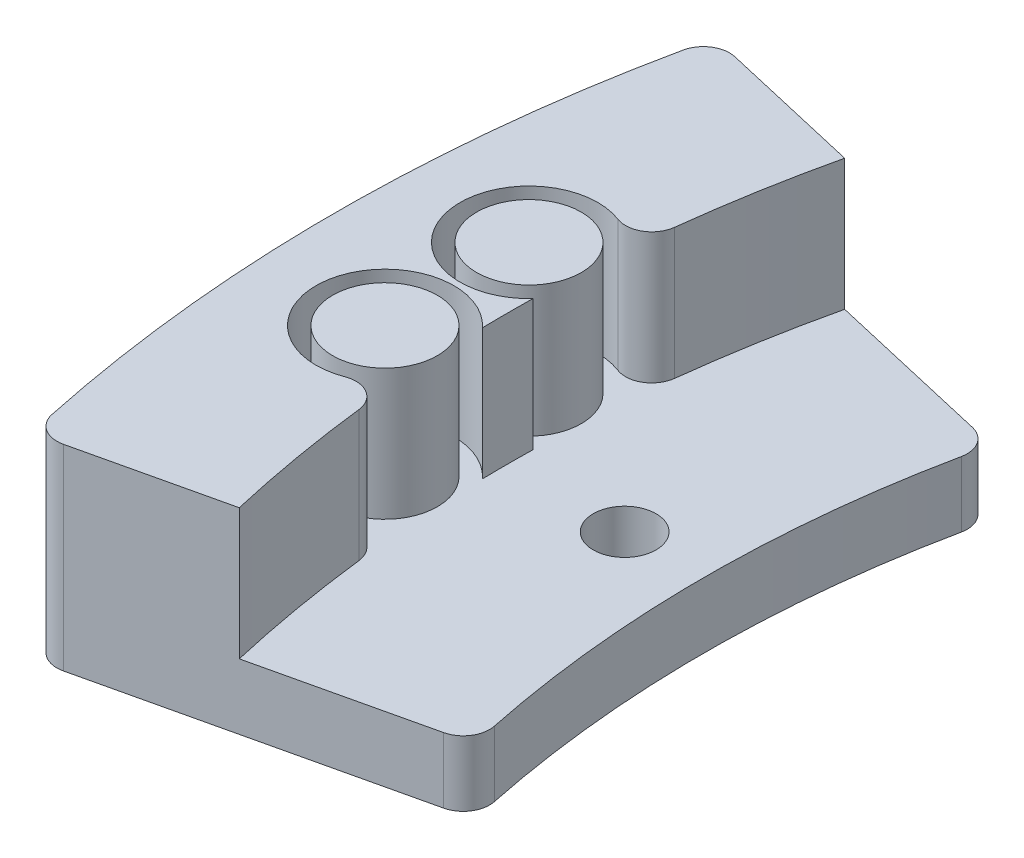
ISO-10303-21;
HEADER;
FILE_DESCRIPTION(('STEP AP214'),'2;1');
FILE_NAME('part.step','',(''),(''),'','','');
FILE_SCHEMA(('AUTOMOTIVE_DESIGN { 1 0 10303 214 1 1 1 1 }'));
ENDSEC;
DATA;
#1=APPLICATION_CONTEXT('core data for automotive mechanical design processes');
#2=APPLICATION_PROTOCOL_DEFINITION('international standard','automotive_design',2000,#1);
#3=PRODUCT_CONTEXT('',#1,'mechanical');
#4=PRODUCT('Part','Part','',(#3));
#5=PRODUCT_RELATED_PRODUCT_CATEGORY('part','',(#4));
#6=PRODUCT_DEFINITION_FORMATION('','',#4);
#7=PRODUCT_DEFINITION_CONTEXT('part definition',#1,'design');
#8=PRODUCT_DEFINITION('design','',#6,#7);
#9=PRODUCT_DEFINITION_SHAPE('','',#8);
#10=(LENGTH_UNIT() NAMED_UNIT(*) SI_UNIT(.MILLI.,.METRE.));
#11=(NAMED_UNIT(*) PLANE_ANGLE_UNIT() SI_UNIT($,.RADIAN.));
#12=(NAMED_UNIT(*) SI_UNIT($,.STERADIAN.) SOLID_ANGLE_UNIT());
#13=UNCERTAINTY_MEASURE_WITH_UNIT(LENGTH_MEASURE(1.E-05),#10,'distance_accuracy_value','');
#14=(GEOMETRIC_REPRESENTATION_CONTEXT(3) GLOBAL_UNCERTAINTY_ASSIGNED_CONTEXT((#13)) GLOBAL_UNIT_ASSIGNED_CONTEXT((#10,
#11,#12)) REPRESENTATION_CONTEXT('',''));
#15=CARTESIAN_POINT('',(0.,0.,0.));
#16=DIRECTION('',(0.,0.,1.));
#17=DIRECTION('',(1.,0.,0.));
#18=AXIS2_PLACEMENT_3D('',#15,#16,#17);
#19=CARTESIAN_POINT('',(100.252220984126,15.,-12.5));
#20=DIRECTION('',(0.,-1.,0.));
#21=DIRECTION('',(0.,0.,-1.));
#22=AXIS2_PLACEMENT_3D('',#19,#20,#21);
#23=CYLINDRICAL_SURFACE('',#22,102.8065);
#24=CARTESIAN_POINT('',(100.252220984126,15.,-12.5));
#25=DIRECTION('',(0.,-1.,0.));
#26=DIRECTION('',(0.,0.,1.));
#27=AXIS2_PLACEMENT_3D('',#24,#25,#26);
#28=CIRCLE('',#27,102.8065);
#29=CARTESIAN_POINT('',(-1.84430132470093,15.,-24.5613670325234));
#30=VERTEX_POINT('',#29);
#31=CARTESIAN_POINT('',(0.0806449187823882,15.,-35.6264305684019));
#32=VERTEX_POINT('',#31);
#33=EDGE_CURVE('E276',#30,#32,#28,.T.);
#34=ORIENTED_EDGE('',*,*,#33,.F.);
#35=DIRECTION('',(0.,-1.,0.));
#36=VECTOR('',#35,1.);
#37=CARTESIAN_POINT('',(-1.84430132470093,15.,-24.5613670325234));
#38=LINE('',#37,#36);
#39=CARTESIAN_POINT('',(-1.84430132470093,5.,-24.5613670325234));
#40=VERTEX_POINT('',#39);
#41=EDGE_CURVE('E255',#30,#40,#38,.T.);
#42=ORIENTED_EDGE('',*,*,#41,.T.);
#43=CARTESIAN_POINT('',(100.252220984126,5.,-12.5));
#44=DIRECTION('',(0.,-1.,0.));
#45=DIRECTION('',(0.,0.,1.));
#46=AXIS2_PLACEMENT_3D('',#43,#44,#45);
#47=CIRCLE('',#46,102.8065);
#48=CARTESIAN_POINT('',(0.0806449187823882,5.,-35.6264305684019));
#49=VERTEX_POINT('',#48);
#50=EDGE_CURVE('E176',#40,#49,#47,.T.);
#51=ORIENTED_EDGE('',*,*,#50,.T.);
#52=DIRECTION('',(0.,-1.,0.));
#53=VECTOR('',#52,1.);
#54=CARTESIAN_POINT('',(0.0806449187823882,15.,-35.6264305684019));
#55=LINE('',#54,#53);
#56=EDGE_CURVE('E184',#32,#49,#55,.T.);
#57=ORIENTED_EDGE('',*,*,#56,.F.);
#58=EDGE_LOOP('',(#34,#42,#51,#57));
#59=FACE_BOUND('',#58,.T.);
#60=ADVANCED_FACE('F33',(#59),#23,.F.);
#61=DIRECTION('',(0.,1.,0.));
#62=VECTOR('',#61,1.);
#63=CARTESIAN_POINT('',(-2.53616517648448,10.,-14.4297960377366));
#64=LINE('',#63,#62);
#65=CARTESIAN_POINT('',(-2.53616517648448,15.,-14.4297960377366));
#66=VERTEX_POINT('',#65);
#67=CARTESIAN_POINT('',(-2.53616517648448,5.,-14.4297960377366));
#68=VERTEX_POINT('',#67);
#69=EDGE_CURVE('E163',#66,#68,#64,.F.);
#70=ORIENTED_EDGE('',*,*,#69,.F.);
#71=CARTESIAN_POINT('',(-2.53616517648446,15.,-10.5702039622635));
#72=VERTEX_POINT('',#71);
#73=EDGE_CURVE('E275',#72,#66,#28,.T.);
#74=ORIENTED_EDGE('',*,*,#73,.F.);
#75=DIRECTION('',(0.,1.,0.));
#76=VECTOR('',#75,1.);
#77=CARTESIAN_POINT('',(-2.53616517648448,10.,-10.5702039622634));
#78=LINE('',#77,#76);
#79=CARTESIAN_POINT('',(-2.53616517648443,5.,-10.5702039622634));
#80=VERTEX_POINT('',#79);
#81=EDGE_CURVE('E174',#72,#80,#78,.F.);
#82=ORIENTED_EDGE('',*,*,#81,.T.);
#83=EDGE_CURVE('E153',#80,#68,#47,.T.);
#84=ORIENTED_EDGE('',*,*,#83,.T.);
#85=EDGE_LOOP('',(#70,#74,#82,#84));
#86=FACE_BOUND('',#85,.T.);
#87=ADVANCED_FACE('F173',(#86),#23,.F.);
#88=CARTESIAN_POINT('',(100.252220984126,5.,-12.5));
#89=DIRECTION('',(0.,1.,0.));
#90=DIRECTION('',(0.,0.,1.));
#91=AXIS2_PLACEMENT_3D('',#88,#89,#90);
#92=PLANE('',#91);
#93=CARTESIAN_POINT('',(100.252220984126,5.,-12.5));
#94=DIRECTION('',(0.,1.,0.));
#95=DIRECTION('',(0.,0.,-1.));
#96=AXIS2_PLACEMENT_3D('',#93,#94,#95);
#97=CIRCLE('',#96,87.8065);
#98=CARTESIAN_POINT('',(14.2775318548896,5.,-30.3419245425259));
#99=VERTEX_POINT('',#98);
#100=CARTESIAN_POINT('',(14.2775318548897,5.,5.3419245425265));
#101=VERTEX_POINT('',#100);
#102=EDGE_CURVE('E293',#99,#101,#97,.T.);
#103=ORIENTED_EDGE('',*,*,#102,.F.);
#104=CARTESIAN_POINT('',(12.3192556651033,5.,-30.7483164279222));
#105=DIRECTION('',(0.,1.,0.));
#106=DIRECTION('',(0.,0.,1.));
#107=AXIS2_PLACEMENT_3D('',#104,#105,#106);
#108=CIRCLE('',#107,2.);
#109=CARTESIAN_POINT('',(12.769157773791,5.,-32.6970565574927));
#110=VERTEX_POINT('',#109);
#111=EDGE_CURVE('E221',#99,#110,#108,.T.);
#112=ORIENTED_EDGE('',*,*,#111,.T.);
#113=DIRECTION('',(-0.974370064785237,0.,-0.224951054343858));
#114=VECTOR('',#113,1.);
#115=CARTESIAN_POINT('',(100.252220984126,5.,-12.5));
#116=LINE('',#115,#114);
#117=EDGE_CURVE('E200',#110,#49,#116,.T.);
#118=ORIENTED_EDGE('',*,*,#117,.T.);
#119=ORIENTED_EDGE('',*,*,#50,.F.);
#120=CARTESIAN_POINT('',(-3.83048940247473,5.,-24.7960091423612));
#121=DIRECTION('',(0.,1.,0.));
#122=DIRECTION('',(0.,0.,1.));
#123=AXIS2_PLACEMENT_3D('',#120,#121,#122);
#124=CIRCLE('',#123,2.);
#125=CARTESIAN_POINT('',(-4.54082898386525,5.,-22.9264055268561));
#126=VERTEX_POINT('',#125);
#127=EDGE_CURVE('E41',#40,#126,#124,.F.);
#128=ORIENTED_EDGE('',*,*,#127,.T.);
#129=CARTESIAN_POINT('',(-6.41257378082929,5.,-18.));
#130=DIRECTION('',(0.,1.,0.));
#131=DIRECTION('',(0.,0.,1.));
#132=AXIS2_PLACEMENT_3D('',#129,#130,#131);
#133=CIRCLE('',#132,5.27);
#134=EDGE_CURVE('E146',#126,#68,#133,.T.);
#135=ORIENTED_EDGE('',*,*,#134,.T.);
#136=ORIENTED_EDGE('',*,*,#83,.F.);
#137=CARTESIAN_POINT('',(-6.41257378082929,5.,-7.));
#138=DIRECTION('',(0.,1.,0.));
#139=DIRECTION('',(0.,0.,1.));
#140=AXIS2_PLACEMENT_3D('',#137,#138,#139);
#141=CIRCLE('',#140,5.27);
#142=CARTESIAN_POINT('',(-4.54082898386525,5.,-2.07359447314393));
#143=VERTEX_POINT('',#142);
#144=EDGE_CURVE('E262',#143,#80,#141,.F.);
#145=ORIENTED_EDGE('',*,*,#144,.F.);
#146=CARTESIAN_POINT('',(-3.83048940247473,5.,-0.203990857638821));
#147=DIRECTION('',(0.,1.,0.));
#148=DIRECTION('',(0.,0.,1.));
#149=AXIS2_PLACEMENT_3D('',#146,#147,#148);
#150=CIRCLE('',#149,2.);
#151=CARTESIAN_POINT('',(-1.84430132470093,5.,-0.438632967476687));
#152=VERTEX_POINT('',#151);
#153=EDGE_CURVE('E11',#143,#152,#150,.F.);
#154=ORIENTED_EDGE('',*,*,#153,.T.);
#155=CARTESIAN_POINT('',(0.0806449187825548,5.,10.6264305684026));
#156=VERTEX_POINT('',#155);
#157=EDGE_CURVE('E175',#156,#152,#47,.T.);
#158=ORIENTED_EDGE('',*,*,#157,.F.);
#159=DIRECTION('',(0.974370064785235,0.,-0.224951054343865));
#160=VECTOR('',#159,1.);
#161=CARTESIAN_POINT('',(-12.8024760778078,5.,13.6007334089372));
#162=LINE('',#161,#160);
#163=CARTESIAN_POINT('',(12.7691577737911,5.,7.6970565574933));
#164=VERTEX_POINT('',#163);
#165=EDGE_CURVE('E197',#156,#164,#162,.T.);
#166=ORIENTED_EDGE('',*,*,#165,.T.);
#167=CARTESIAN_POINT('',(12.3192556651034,5.,5.74831642792283));
#168=DIRECTION('',(0.,1.,0.));
#169=DIRECTION('',(0.,0.,1.));
#170=AXIS2_PLACEMENT_3D('',#167,#168,#169);
#171=CIRCLE('',#170,2.);
#172=EDGE_CURVE('E219',#164,#101,#171,.T.);
#173=ORIENTED_EDGE('',*,*,#172,.T.);
#174=EDGE_LOOP('',(#103,#112,#118,#119,#128,#135,#136,#145,#154,#158,#166,#173));
#175=FACE_BOUND('',#174,.T.);
#176=CARTESIAN_POINT('',(-6.41257378082929,5.,-18.));
#177=DIRECTION('',(0.,1.,0.));
#178=DIRECTION('',(0.,0.,1.));
#179=AXIS2_PLACEMENT_3D('',#176,#177,#178);
#180=CIRCLE('',#179,4.);
#181=CARTESIAN_POINT('',(-6.41257378082929,5.,-14.));
#182=VERTEX_POINT('',#181);
#183=EDGE_CURVE('E159',#182,#182,#180,.T.);
#184=ORIENTED_EDGE('',*,*,#183,.F.);
#185=EDGE_LOOP('',(#184));
#186=FACE_BOUND('',#185,.T.);
#187=CARTESIAN_POINT('',(6.39732098412583,5.,-12.5));
#188=DIRECTION('',(0.,1.,0.));
#189=DIRECTION('',(0.,0.,1.));
#190=AXIS2_PLACEMENT_3D('',#187,#188,#189);
#191=CIRCLE('',#190,2.4);
#192=CARTESIAN_POINT('',(6.39732098412583,5.,-10.1));
#193=VERTEX_POINT('',#192);
#194=EDGE_CURVE('E191',#193,#193,#191,.T.);
#195=ORIENTED_EDGE('',*,*,#194,.F.);
#196=EDGE_LOOP('',(#195));
#197=FACE_BOUND('',#196,.T.);
#198=CARTESIAN_POINT('',(-6.41257378082929,5.,-7.));
#199=DIRECTION('',(0.,1.,0.));
#200=DIRECTION('',(0.,0.,1.));
#201=AXIS2_PLACEMENT_3D('',#198,#199,#200);
#202=CIRCLE('',#201,4.);
#203=CARTESIAN_POINT('',(-6.41257378082929,5.,-3.));
#204=VERTEX_POINT('',#203);
#205=EDGE_CURVE('E264',#204,#204,#202,.F.);
#206=ORIENTED_EDGE('',*,*,#205,.T.);
#207=EDGE_LOOP('',(#206));
#208=FACE_BOUND('',#207,.T.);
#209=ADVANCED_FACE('F149',(#175,#186,#197,#208),#92,.T.);
#210=CARTESIAN_POINT('',(100.252220984126,0.,-12.5));
#211=DIRECTION('',(0.,1.,0.));
#212=DIRECTION('',(0.,0.,1.));
#213=AXIS2_PLACEMENT_3D('',#210,#211,#212);
#214=PLANE('',#213);
#215=DIRECTION('',(-0.974370064785237,0.,-0.224951054343858));
#216=VECTOR('',#215,1.);
#217=CARTESIAN_POINT('',(100.252220984126,0.,-12.5));
#218=LINE('',#217,#216);
#219=CARTESIAN_POINT('',(12.769157773791,0.,-32.6970565574927));
#220=VERTEX_POINT('',#219);
#221=CARTESIAN_POINT('',(-10.8366446944992,0.,-38.146885473414));
#222=VERTEX_POINT('',#221);
#223=EDGE_CURVE('E207',#220,#222,#218,.T.);
#224=ORIENTED_EDGE('',*,*,#223,.F.);
#225=CARTESIAN_POINT('',(12.3192556651033,0.,-30.7483164279222));
#226=DIRECTION('',(0.,1.,0.));
#227=DIRECTION('',(0.,0.,1.));
#228=AXIS2_PLACEMENT_3D('',#225,#226,#227);
#229=CIRCLE('',#228,2.);
#230=CARTESIAN_POINT('',(14.2775318548896,0.,-30.3419245425259));
#231=VERTEX_POINT('',#230);
#232=EDGE_CURVE('E233',#220,#231,#229,.F.);
#233=ORIENTED_EDGE('',*,*,#232,.T.);
#234=CARTESIAN_POINT('',(100.252220984126,0.,-12.5));
#235=DIRECTION('',(0.,1.,0.));
#236=DIRECTION('',(0.,0.,-1.));
#237=AXIS2_PLACEMENT_3D('',#234,#235,#236);
#238=CIRCLE('',#237,87.8065);
#239=CARTESIAN_POINT('',(14.2775318548897,0.,5.3419245425265));
#240=VERTEX_POINT('',#239);
#241=EDGE_CURVE('E292',#231,#240,#238,.T.);
#242=ORIENTED_EDGE('',*,*,#241,.T.);
#243=CARTESIAN_POINT('',(12.3192556651034,0.,5.74831642792283));
#244=DIRECTION('',(0.,1.,0.));
#245=DIRECTION('',(0.,0.,1.));
#246=AXIS2_PLACEMENT_3D('',#243,#244,#245);
#247=CIRCLE('',#246,2.);
#248=CARTESIAN_POINT('',(12.7691577737911,0.,7.6970565574933));
#249=VERTEX_POINT('',#248);
#250=EDGE_CURVE('E231',#240,#249,#247,.F.);
#251=ORIENTED_EDGE('',*,*,#250,.T.);
#252=DIRECTION('',(0.974370064785235,0.,-0.224951054343865));
#253=VECTOR('',#252,1.);
#254=CARTESIAN_POINT('',(-12.8024760778078,0.,13.6007334089372));
#255=LINE('',#254,#253);
#256=CARTESIAN_POINT('',(-10.836644694499,0.,13.1468854734148));
#257=VERTEX_POINT('',#256);
#258=EDGE_CURVE('E194',#257,#249,#255,.T.);
#259=ORIENTED_EDGE('',*,*,#258,.F.);
#260=CARTESIAN_POINT('',(-11.2865468031867,0.,11.1981453438443));
#261=DIRECTION('',(0.,1.,0.));
#262=DIRECTION('',(0.,0.,1.));
#263=AXIS2_PLACEMENT_3D('',#260,#261,#262);
#264=CIRCLE('',#263,2.);
#265=CARTESIAN_POINT('',(-13.2428782078323,0.,11.6137983664456));
#266=VERTEX_POINT('',#265);
#267=EDGE_CURVE('E227',#257,#266,#264,.F.);
#268=ORIENTED_EDGE('',*,*,#267,.T.);
#269=CARTESIAN_POINT('',(100.252220984126,0.,-12.5));
#270=DIRECTION('',(0.,1.,0.));
#271=DIRECTION('',(0.,0.,1.));
#272=AXIS2_PLACEMENT_3D('',#269,#270,#271);
#273=CIRCLE('',#272,116.0285);
#274=CARTESIAN_POINT('',(-13.2428782078324,0.,-36.6137983664448));
#275=VERTEX_POINT('',#274);
#276=EDGE_CURVE('E201',#275,#266,#273,.T.);
#277=ORIENTED_EDGE('',*,*,#276,.F.);
#278=CARTESIAN_POINT('',(-11.2865468031869,0.,-36.1981453438435));
#279=DIRECTION('',(0.,1.,0.));
#280=DIRECTION('',(0.,0.,1.));
#281=AXIS2_PLACEMENT_3D('',#278,#279,#280);
#282=CIRCLE('',#281,2.);
#283=EDGE_CURVE('E229',#275,#222,#282,.F.);
#284=ORIENTED_EDGE('',*,*,#283,.T.);
#285=EDGE_LOOP('',(#224,#233,#242,#251,#259,#268,#277,#284));
#286=FACE_BOUND('',#285,.T.);
#287=CARTESIAN_POINT('',(6.39732098412583,0.,-12.5));
#288=DIRECTION('',(0.,1.,0.));
#289=DIRECTION('',(0.,0.,1.));
#290=AXIS2_PLACEMENT_3D('',#287,#288,#289);
#291=CIRCLE('',#290,2.4);
#292=CARTESIAN_POINT('',(6.39732098412583,0.,-10.1));
#293=VERTEX_POINT('',#292);
#294=EDGE_CURVE('E190',#293,#293,#291,.T.);
#295=ORIENTED_EDGE('',*,*,#294,.T.);
#296=EDGE_LOOP('',(#295));
#297=FACE_BOUND('',#296,.T.);
#298=ADVANCED_FACE('F301',(#286,#297),#214,.F.);
#299=CARTESIAN_POINT('',(-12.8024760778078,5.,13.6007334089372));
#300=DIRECTION('',(-0.224951054343865,0.,-0.974370064785235));
#301=DIRECTION('',(-0.974370064785235,0.,0.224951054343865));
#302=AXIS2_PLACEMENT_3D('',#299,#300,#301);
#303=PLANE('',#302);
#304=ORIENTED_EDGE('',*,*,#258,.T.);
#305=DIRECTION('',(0.,1.,0.));
#306=VECTOR('',#305,1.);
#307=CARTESIAN_POINT('',(12.7691577737911,5.,7.6970565574933));
#308=LINE('',#307,#306);
#309=EDGE_CURVE('E238',#249,#164,#308,.T.);
#310=ORIENTED_EDGE('',*,*,#309,.T.);
#311=ORIENTED_EDGE('',*,*,#165,.F.);
#312=DIRECTION('',(0.,-1.,0.));
#313=VECTOR('',#312,1.);
#314=CARTESIAN_POINT('',(0.0806449187825509,15.,10.6264305684025));
#315=LINE('',#314,#313);
#316=CARTESIAN_POINT('',(0.0806449187825509,15.,10.6264305684025));
#317=VERTEX_POINT('',#316);
#318=EDGE_CURVE('E187',#317,#156,#315,.T.);
#319=ORIENTED_EDGE('',*,*,#318,.F.);
#320=DIRECTION('',(0.974370064785235,0.,-0.224951054343865));
#321=VECTOR('',#320,1.);
#322=CARTESIAN_POINT('',(0.0806449187825509,15.,10.6264305684025));
#323=LINE('',#322,#321);
#324=CARTESIAN_POINT('',(-10.836644694499,15.,13.1468854734148));
#325=VERTEX_POINT('',#324);
#326=EDGE_CURVE('E273',#325,#317,#323,.T.);
#327=ORIENTED_EDGE('',*,*,#326,.F.);
#328=DIRECTION('',(0.,-1.,0.));
#329=VECTOR('',#328,1.);
#330=CARTESIAN_POINT('',(-10.836644694499,5.,13.1468854734148));
#331=LINE('',#330,#329);
#332=EDGE_CURVE('E235',#325,#257,#331,.T.);
#333=ORIENTED_EDGE('',*,*,#332,.T.);
#334=EDGE_LOOP('',(#304,#310,#311,#319,#327,#333));
#335=FACE_BOUND('',#334,.T.);
#336=ADVANCED_FACE('F313',(#335),#303,.F.);
#337=CARTESIAN_POINT('',(100.252220984126,5.,-12.5));
#338=DIRECTION('',(-0.224951054343859,0.,0.974370064785237));
#339=DIRECTION('',(0.974370064785237,0.,0.224951054343859));
#340=AXIS2_PLACEMENT_3D('',#337,#338,#339);
#341=PLANE('',#340);
#342=ORIENTED_EDGE('',*,*,#117,.F.);
#343=DIRECTION('',(0.,1.,0.));
#344=VECTOR('',#343,1.);
#345=CARTESIAN_POINT('',(12.769157773791,5.,-32.6970565574927));
#346=LINE('',#345,#344);
#347=EDGE_CURVE('E225',#110,#220,#346,.F.);
#348=ORIENTED_EDGE('',*,*,#347,.T.);
#349=ORIENTED_EDGE('',*,*,#223,.T.);
#350=DIRECTION('',(0.,-1.,0.));
#351=VECTOR('',#350,1.);
#352=CARTESIAN_POINT('',(-10.8366446944992,5.,-38.146885473414));
#353=LINE('',#352,#351);
#354=CARTESIAN_POINT('',(-10.8366446944992,15.,-38.146885473414));
#355=VERTEX_POINT('',#354);
#356=EDGE_CURVE('E223',#222,#355,#353,.F.);
#357=ORIENTED_EDGE('',*,*,#356,.T.);
#358=DIRECTION('',(-0.974370064785237,0.,-0.224951054343858));
#359=VECTOR('',#358,1.);
#360=CARTESIAN_POINT('',(0.080644918782389,15.,-35.6264305684019));
#361=LINE('',#360,#359);
#362=EDGE_CURVE('E182',#32,#355,#361,.T.);
#363=ORIENTED_EDGE('',*,*,#362,.F.);
#364=ORIENTED_EDGE('',*,*,#56,.T.);
#365=EDGE_LOOP('',(#342,#348,#349,#357,#363,#364));
#366=FACE_BOUND('',#365,.T.);
#367=ADVANCED_FACE('F320',(#366),#341,.F.);
#368=CARTESIAN_POINT('',(100.252220984126,5.,-12.5));
#369=DIRECTION('',(0.,-1.,0.));
#370=DIRECTION('',(0.,0.,-1.));
#371=AXIS2_PLACEMENT_3D('',#368,#369,#370);
#372=CYLINDRICAL_SURFACE('',#371,116.0285);
#373=CARTESIAN_POINT('',(100.252220984126,15.,-12.5));
#374=DIRECTION('',(0.,1.,0.));
#375=DIRECTION('',(0.,0.,1.));
#376=AXIS2_PLACEMENT_3D('',#373,#374,#375);
#377=CIRCLE('',#376,116.0285);
#378=CARTESIAN_POINT('',(-13.2428782078324,15.,-36.6137983664448));
#379=VERTEX_POINT('',#378);
#380=CARTESIAN_POINT('',(-13.2428782078323,15.,11.6137983664456));
#381=VERTEX_POINT('',#380);
#382=EDGE_CURVE('E179',#379,#381,#377,.T.);
#383=ORIENTED_EDGE('',*,*,#382,.F.);
#384=DIRECTION('',(0.,-1.,0.));
#385=VECTOR('',#384,1.);
#386=CARTESIAN_POINT('',(-13.2428782078324,5.,-36.6137983664448));
#387=LINE('',#386,#385);
#388=EDGE_CURVE('E243',#379,#275,#387,.T.);
#389=ORIENTED_EDGE('',*,*,#388,.T.);
#390=ORIENTED_EDGE('',*,*,#276,.T.);
#391=DIRECTION('',(0.,-1.,0.));
#392=VECTOR('',#391,1.);
#393=CARTESIAN_POINT('',(-13.2428782078323,5.,11.6137983664456));
#394=LINE('',#393,#392);
#395=EDGE_CURVE('E241',#266,#381,#394,.F.);
#396=ORIENTED_EDGE('',*,*,#395,.T.);
#397=EDGE_LOOP('',(#383,#389,#390,#396));
#398=FACE_BOUND('',#397,.T.);
#399=ADVANCED_FACE('F352',(#398),#372,.T.);
#400=CARTESIAN_POINT('',(6.39732098412583,5.,-12.5));
#401=DIRECTION('',(0.,-1.,0.));
#402=DIRECTION('',(0.,0.,-1.));
#403=AXIS2_PLACEMENT_3D('',#400,#401,#402);
#404=CYLINDRICAL_SURFACE('',#403,2.4);
#405=ORIENTED_EDGE('',*,*,#194,.T.);
#406=EDGE_LOOP('',(#405));
#407=FACE_BOUND('',#406,.T.);
#408=ORIENTED_EDGE('',*,*,#294,.F.);
#409=EDGE_LOOP('',(#408));
#410=FACE_BOUND('',#409,.T.);
#411=ADVANCED_FACE('F345',(#407,#410),#404,.F.);
#412=ORIENTED_EDGE('',*,*,#157,.T.);
#413=DIRECTION('',(0.,-1.,0.));
#414=VECTOR('',#413,1.);
#415=CARTESIAN_POINT('',(-1.84430132470094,15.,-0.438632967476683));
#416=LINE('',#415,#414);
#417=CARTESIAN_POINT('',(-1.84430132470093,15.,-0.438632967476687));
#418=VERTEX_POINT('',#417);
#419=EDGE_CURVE('E257',#152,#418,#416,.F.);
#420=ORIENTED_EDGE('',*,*,#419,.T.);
#421=EDGE_CURVE('E269',#317,#418,#28,.T.);
#422=ORIENTED_EDGE('',*,*,#421,.F.);
#423=ORIENTED_EDGE('',*,*,#318,.T.);
#424=EDGE_LOOP('',(#412,#420,#422,#423));
#425=FACE_BOUND('',#424,.T.);
#426=ADVANCED_FACE('F268',(#425),#23,.F.);
#427=CARTESIAN_POINT('',(100.252220984126,15.,-12.5));
#428=DIRECTION('',(0.,1.,0.));
#429=DIRECTION('',(0.,0.,1.));
#430=AXIS2_PLACEMENT_3D('',#427,#428,#429);
#431=PLANE('',#430);
#432=ORIENTED_EDGE('',*,*,#362,.T.);
#433=CARTESIAN_POINT('',(-11.2865468031869,15.,-36.1981453438435));
#434=DIRECTION('',(0.,1.,0.));
#435=DIRECTION('',(0.,0.,1.));
#436=AXIS2_PLACEMENT_3D('',#433,#434,#435);
#437=CIRCLE('',#436,2.);
#438=EDGE_CURVE('E251',#355,#379,#437,.T.);
#439=ORIENTED_EDGE('',*,*,#438,.T.);
#440=ORIENTED_EDGE('',*,*,#382,.T.);
#441=CARTESIAN_POINT('',(-11.2865468031867,15.,11.1981453438443));
#442=DIRECTION('',(0.,1.,0.));
#443=DIRECTION('',(0.,0.,1.));
#444=AXIS2_PLACEMENT_3D('',#441,#442,#443);
#445=CIRCLE('',#444,2.);
#446=EDGE_CURVE('E247',#381,#325,#445,.T.);
#447=ORIENTED_EDGE('',*,*,#446,.T.);
#448=ORIENTED_EDGE('',*,*,#326,.T.);
#449=ORIENTED_EDGE('',*,*,#421,.T.);
#450=CARTESIAN_POINT('',(-3.83048940247473,15.,-0.203990857638821));
#451=DIRECTION('',(0.,1.,0.));
#452=DIRECTION('',(0.,0.,1.));
#453=AXIS2_PLACEMENT_3D('',#450,#451,#452);
#454=CIRCLE('',#453,2.);
#455=CARTESIAN_POINT('',(-4.54082898386525,15.,-2.07359447314393));
#456=VERTEX_POINT('',#455);
#457=EDGE_CURVE('E48',#418,#456,#454,.T.);
#458=ORIENTED_EDGE('',*,*,#457,.T.);
#459=CARTESIAN_POINT('',(-6.41257378082929,15.,-7.));
#460=DIRECTION('',(0.,1.,0.));
#461=DIRECTION('',(0.,0.,1.));
#462=AXIS2_PLACEMENT_3D('',#459,#460,#461);
#463=CIRCLE('',#462,5.27);
#464=EDGE_CURVE('E204',#72,#456,#463,.T.);
#465=ORIENTED_EDGE('',*,*,#464,.F.);
#466=ORIENTED_EDGE('',*,*,#73,.T.);
#467=CARTESIAN_POINT('',(-6.41257378082929,15.,-18.));
#468=DIRECTION('',(0.,1.,0.));
#469=DIRECTION('',(0.,0.,1.));
#470=AXIS2_PLACEMENT_3D('',#467,#468,#469);
#471=CIRCLE('',#470,5.27);
#472=CARTESIAN_POINT('',(-4.54082898386525,15.,-22.9264055268561));
#473=VERTEX_POINT('',#472);
#474=EDGE_CURVE('E166',#66,#473,#471,.F.);
#475=ORIENTED_EDGE('',*,*,#474,.T.);
#476=CARTESIAN_POINT('',(-3.83048940247473,15.,-24.7960091423612));
#477=DIRECTION('',(0.,1.,0.));
#478=DIRECTION('',(0.,0.,1.));
#479=AXIS2_PLACEMENT_3D('',#476,#477,#478);
#480=CIRCLE('',#479,2.);
#481=EDGE_CURVE('E249',#473,#30,#480,.T.);
#482=ORIENTED_EDGE('',*,*,#481,.T.);
#483=ORIENTED_EDGE('',*,*,#33,.T.);
#484=EDGE_LOOP('',(#432,#439,#440,#447,#448,#449,#458,#465,#466,#475,#482,#483));
#485=FACE_BOUND('',#484,.T.);
#486=ADVANCED_FACE('F271',(#485),#431,.T.);
#487=CARTESIAN_POINT('',(-6.41257378082929,-9.90581094741242,-7.));
#488=DIRECTION('',(0.,1.,0.));
#489=DIRECTION('',(0.,0.,1.));
#490=AXIS2_PLACEMENT_3D('',#487,#488,#489);
#491=CYLINDRICAL_SURFACE('',#490,5.27);
#492=ORIENTED_EDGE('',*,*,#464,.T.);
#493=DIRECTION('',(0.,1.,0.));
#494=VECTOR('',#493,1.);
#495=CARTESIAN_POINT('',(-4.54082898386525,-9.90581094741242,-2.07359447314393));
#496=LINE('',#495,#494);
#497=EDGE_CURVE('E259',#456,#143,#496,.F.);
#498=ORIENTED_EDGE('',*,*,#497,.T.);
#499=ORIENTED_EDGE('',*,*,#144,.T.);
#500=ORIENTED_EDGE('',*,*,#81,.F.);
#501=EDGE_LOOP('',(#492,#498,#499,#500));
#502=FACE_BOUND('',#501,.T.);
#503=ADVANCED_FACE('F261',(#502),#491,.F.);
#504=CARTESIAN_POINT('',(-6.41257378082929,-9.90581094741242,-7.));
#505=DIRECTION('',(0.,1.,0.));
#506=DIRECTION('',(0.,0.,1.));
#507=AXIS2_PLACEMENT_3D('',#504,#505,#506);
#508=CYLINDRICAL_SURFACE('',#507,4.);
#509=CARTESIAN_POINT('',(-6.41257378082929,15.,-7.));
#510=DIRECTION('',(0.,1.,0.));
#511=DIRECTION('',(0.,0.,1.));
#512=AXIS2_PLACEMENT_3D('',#509,#510,#511);
#513=CIRCLE('',#512,4.);
#514=CARTESIAN_POINT('',(-6.41257378082929,15.,-3.));
#515=VERTEX_POINT('',#514);
#516=EDGE_CURVE('E170',#515,#515,#513,.T.);
#517=ORIENTED_EDGE('',*,*,#516,.F.);
#518=EDGE_LOOP('',(#517));
#519=FACE_BOUND('',#518,.T.);
#520=ORIENTED_EDGE('',*,*,#205,.F.);
#521=EDGE_LOOP('',(#520));
#522=FACE_BOUND('',#521,.T.);
#523=ADVANCED_FACE('F461',(#519,#522),#508,.T.);
#524=ORIENTED_EDGE('',*,*,#516,.T.);
#525=EDGE_LOOP('',(#524));
#526=FACE_BOUND('',#525,.T.);
#527=ADVANCED_FACE('F351',(#526),#431,.T.);
#528=CARTESIAN_POINT('',(-6.41257378082929,-9.90581094741242,-18.));
#529=DIRECTION('',(0.,1.,0.));
#530=DIRECTION('',(0.,0.,1.));
#531=AXIS2_PLACEMENT_3D('',#528,#529,#530);
#532=CYLINDRICAL_SURFACE('',#531,5.27);
#533=ORIENTED_EDGE('',*,*,#134,.F.);
#534=DIRECTION('',(0.,1.,0.));
#535=VECTOR('',#534,1.);
#536=CARTESIAN_POINT('',(-4.54082898386525,-9.90581094741242,-22.9264055268561));
#537=LINE('',#536,#535);
#538=EDGE_CURVE('E253',#126,#473,#537,.T.);
#539=ORIENTED_EDGE('',*,*,#538,.T.);
#540=ORIENTED_EDGE('',*,*,#474,.F.);
#541=ORIENTED_EDGE('',*,*,#69,.T.);
#542=EDGE_LOOP('',(#533,#539,#540,#541));
#543=FACE_BOUND('',#542,.T.);
#544=ADVANCED_FACE('F164',(#543),#532,.F.);
#545=CARTESIAN_POINT('',(-6.41257378082929,-9.90581094741242,-18.));
#546=DIRECTION('',(0.,1.,0.));
#547=DIRECTION('',(0.,0.,1.));
#548=AXIS2_PLACEMENT_3D('',#545,#546,#547);
#549=CYLINDRICAL_SURFACE('',#548,4.);
#550=CARTESIAN_POINT('',(-6.41257378082929,15.,-18.));
#551=DIRECTION('',(0.,-1.,0.));
#552=DIRECTION('',(0.,0.,-1.));
#553=AXIS2_PLACEMENT_3D('',#550,#551,#552);
#554=CIRCLE('',#553,4.);
#555=CARTESIAN_POINT('',(-6.41257378082929,15.,-22.));
#556=VERTEX_POINT('',#555);
#557=EDGE_CURVE('E160',#556,#556,#554,.T.);
#558=ORIENTED_EDGE('',*,*,#557,.T.);
#559=EDGE_LOOP('',(#558));
#560=FACE_BOUND('',#559,.T.);
#561=ORIENTED_EDGE('',*,*,#183,.T.);
#562=EDGE_LOOP('',(#561));
#563=FACE_BOUND('',#562,.T.);
#564=ADVANCED_FACE('F416',(#560,#563),#549,.T.);
#565=ORIENTED_EDGE('',*,*,#557,.F.);
#566=EDGE_LOOP('',(#565));
#567=FACE_BOUND('',#566,.T.);
#568=ADVANCED_FACE('F350',(#567),#431,.T.);
#569=CARTESIAN_POINT('',(100.252220984126,0.,-12.5));
#570=DIRECTION('',(0.,1.,0.));
#571=DIRECTION('',(0.,0.,1.));
#572=AXIS2_PLACEMENT_3D('',#569,#570,#571);
#573=CYLINDRICAL_SURFACE('',#572,87.8065);
#574=ORIENTED_EDGE('',*,*,#241,.F.);
#575=DIRECTION('',(0.,1.,0.));
#576=VECTOR('',#575,1.);
#577=CARTESIAN_POINT('',(14.2775318548896,0.,-30.3419245425259));
#578=LINE('',#577,#576);
#579=EDGE_CURVE('E216',#231,#99,#578,.T.);
#580=ORIENTED_EDGE('',*,*,#579,.T.);
#581=ORIENTED_EDGE('',*,*,#102,.T.);
#582=DIRECTION('',(0.,1.,0.));
#583=VECTOR('',#582,1.);
#584=CARTESIAN_POINT('',(14.2775318548897,0.,5.3419245425265));
#585=LINE('',#584,#583);
#586=EDGE_CURVE('E214',#101,#240,#585,.F.);
#587=ORIENTED_EDGE('',*,*,#586,.T.);
#588=EDGE_LOOP('',(#574,#580,#581,#587));
#589=FACE_BOUND('',#588,.T.);
#590=ADVANCED_FACE('F314',(#589),#573,.F.);
#591=CARTESIAN_POINT('',(12.3192556651033,0.,-30.7483164279222));
#592=DIRECTION('',(0.,1.,0.));
#593=DIRECTION('',(0.,0.,1.));
#594=AXIS2_PLACEMENT_3D('',#591,#592,#593);
#595=CYLINDRICAL_SURFACE('',#594,2.);
#596=ORIENTED_EDGE('',*,*,#232,.F.);
#597=ORIENTED_EDGE('',*,*,#347,.F.);
#598=ORIENTED_EDGE('',*,*,#111,.F.);
#599=ORIENTED_EDGE('',*,*,#579,.F.);
#600=EDGE_LOOP('',(#596,#597,#598,#599));
#601=FACE_BOUND('',#600,.T.);
#602=ADVANCED_FACE('F316',(#601),#595,.T.);
#603=CARTESIAN_POINT('',(12.3192556651034,0.,5.74831642792283));
#604=DIRECTION('',(0.,1.,0.));
#605=DIRECTION('',(0.,0.,1.));
#606=AXIS2_PLACEMENT_3D('',#603,#604,#605);
#607=CYLINDRICAL_SURFACE('',#606,2.);
#608=ORIENTED_EDGE('',*,*,#250,.F.);
#609=ORIENTED_EDGE('',*,*,#586,.F.);
#610=ORIENTED_EDGE('',*,*,#172,.F.);
#611=ORIENTED_EDGE('',*,*,#309,.F.);
#612=EDGE_LOOP('',(#608,#609,#610,#611));
#613=FACE_BOUND('',#612,.T.);
#614=ADVANCED_FACE('F310',(#613),#607,.T.);
#615=CARTESIAN_POINT('',(-11.2865468031869,5.,-36.1981453438435));
#616=DIRECTION('',(0.,-1.,0.));
#617=DIRECTION('',(0.,0.,-1.));
#618=AXIS2_PLACEMENT_3D('',#615,#616,#617);
#619=CYLINDRICAL_SURFACE('',#618,2.);
#620=ORIENTED_EDGE('',*,*,#438,.F.);
#621=ORIENTED_EDGE('',*,*,#356,.F.);
#622=ORIENTED_EDGE('',*,*,#283,.F.);
#623=ORIENTED_EDGE('',*,*,#388,.F.);
#624=EDGE_LOOP('',(#620,#621,#622,#623));
#625=FACE_BOUND('',#624,.T.);
#626=ADVANCED_FACE('F328',(#625),#619,.T.);
#627=CARTESIAN_POINT('',(-3.83048940247473,15.,-24.7960091423612));
#628=DIRECTION('',(0.,1.,0.));
#629=DIRECTION('',(0.,0.,1.));
#630=AXIS2_PLACEMENT_3D('',#627,#628,#629);
#631=CYLINDRICAL_SURFACE('',#630,2.);
#632=ORIENTED_EDGE('',*,*,#127,.F.);
#633=ORIENTED_EDGE('',*,*,#41,.F.);
#634=ORIENTED_EDGE('',*,*,#481,.F.);
#635=ORIENTED_EDGE('',*,*,#538,.F.);
#636=EDGE_LOOP('',(#632,#633,#634,#635));
#637=FACE_BOUND('',#636,.T.);
#638=ADVANCED_FACE('F325',(#637),#631,.T.);
#639=CARTESIAN_POINT('',(-11.2865468031867,5.,11.1981453438443));
#640=DIRECTION('',(0.,-1.,0.));
#641=DIRECTION('',(0.,0.,-1.));
#642=AXIS2_PLACEMENT_3D('',#639,#640,#641);
#643=CYLINDRICAL_SURFACE('',#642,2.);
#644=ORIENTED_EDGE('',*,*,#446,.F.);
#645=ORIENTED_EDGE('',*,*,#395,.F.);
#646=ORIENTED_EDGE('',*,*,#267,.F.);
#647=ORIENTED_EDGE('',*,*,#332,.F.);
#648=EDGE_LOOP('',(#644,#645,#646,#647));
#649=FACE_BOUND('',#648,.T.);
#650=ADVANCED_FACE('F327',(#649),#643,.T.);
#651=CARTESIAN_POINT('',(-3.83048940247473,-9.90581094741242,-0.203990857638821));
#652=DIRECTION('',(0.,1.,0.));
#653=DIRECTION('',(0.,0.,1.));
#654=AXIS2_PLACEMENT_3D('',#651,#652,#653);
#655=CYLINDRICAL_SURFACE('',#654,2.);
#656=ORIENTED_EDGE('',*,*,#153,.F.);
#657=ORIENTED_EDGE('',*,*,#497,.F.);
#658=ORIENTED_EDGE('',*,*,#457,.F.);
#659=ORIENTED_EDGE('',*,*,#419,.F.);
#660=EDGE_LOOP('',(#656,#657,#658,#659));
#661=FACE_BOUND('',#660,.T.);
#662=ADVANCED_FACE('F35',(#661),#655,.T.);
#663=CLOSED_SHELL('',(#60,#87,#209,#298,#336,#367,#399,#411,#426,#486,#503,#523,#527,#544,#564,
#568,#590,#602,#614,#626,#638,#650,#662));
#664=MANIFOLD_SOLID_BREP('B2',#663);
#665=ADVANCED_BREP_SHAPE_REPRESENTATION('',(#18,#664),#14);
#666=SHAPE_DEFINITION_REPRESENTATION(#9,#665);
ENDSEC;
END-ISO-10303-21;
